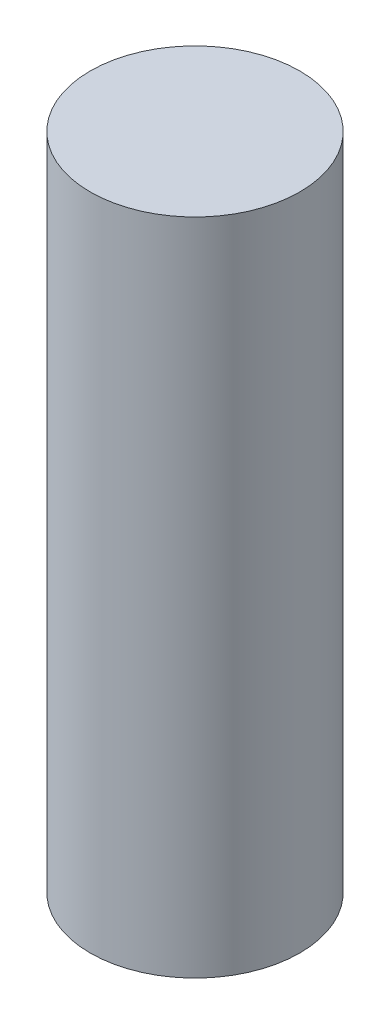
ISO-10303-21;
HEADER;
FILE_DESCRIPTION(('STEP AP214'),'2;1');
FILE_NAME('part.step','',(''),(''),'','','');
FILE_SCHEMA(('AUTOMOTIVE_DESIGN { 1 0 10303 214 1 1 1 1 }'));
ENDSEC;
DATA;
#1=APPLICATION_CONTEXT('core data for automotive mechanical design processes');
#2=APPLICATION_PROTOCOL_DEFINITION('international standard','automotive_design',2000,#1);
#3=PRODUCT_CONTEXT('',#1,'mechanical');
#4=PRODUCT('Part','Part','',(#3));
#5=PRODUCT_RELATED_PRODUCT_CATEGORY('part','',(#4));
#6=PRODUCT_DEFINITION_FORMATION('','',#4);
#7=PRODUCT_DEFINITION_CONTEXT('part definition',#1,'design');
#8=PRODUCT_DEFINITION('design','',#6,#7);
#9=PRODUCT_DEFINITION_SHAPE('','',#8);
#10=(LENGTH_UNIT() NAMED_UNIT(*) SI_UNIT(.MILLI.,.METRE.));
#11=(NAMED_UNIT(*) PLANE_ANGLE_UNIT() SI_UNIT($,.RADIAN.));
#12=(NAMED_UNIT(*) SI_UNIT($,.STERADIAN.) SOLID_ANGLE_UNIT());
#13=UNCERTAINTY_MEASURE_WITH_UNIT(LENGTH_MEASURE(1.E-05),#10,'distance_accuracy_value','');
#14=(GEOMETRIC_REPRESENTATION_CONTEXT(3) GLOBAL_UNCERTAINTY_ASSIGNED_CONTEXT((#13)) GLOBAL_UNIT_ASSIGNED_CONTEXT((#10,
#11,#12)) REPRESENTATION_CONTEXT('',''));
#15=CARTESIAN_POINT('',(0.,0.,0.));
#16=DIRECTION('',(0.,0.,1.));
#17=DIRECTION('',(1.,0.,0.));
#18=AXIS2_PLACEMENT_3D('',#15,#16,#17);
#19=CARTESIAN_POINT('',(0.,10.,0.));
#20=DIRECTION('',(0.,-1.,0.));
#21=DIRECTION('',(0.,0.,-1.));
#22=AXIS2_PLACEMENT_3D('',#19,#20,#21);
#23=CYLINDRICAL_SURFACE('',#22,1.59);
#24=CARTESIAN_POINT('',(0.,10.,0.));
#25=DIRECTION('',(0.,1.,0.));
#26=DIRECTION('',(0.,0.,1.));
#27=AXIS2_PLACEMENT_3D('',#24,#25,#26);
#28=CIRCLE('',#27,1.59);
#29=CARTESIAN_POINT('',(0.,10.,1.59));
#30=VERTEX_POINT('',#29);
#31=EDGE_CURVE('E10',#30,#30,#28,.T.);
#32=ORIENTED_EDGE('',*,*,#31,.F.);
#33=EDGE_LOOP('',(#32));
#34=FACE_BOUND('',#33,.T.);
#35=CARTESIAN_POINT('',(0.,0.,0.));
#36=DIRECTION('',(0.,1.,0.));
#37=DIRECTION('',(0.,0.,1.));
#38=AXIS2_PLACEMENT_3D('',#35,#36,#37);
#39=CIRCLE('',#38,1.59);
#40=CARTESIAN_POINT('',(0.,0.,1.59));
#41=VERTEX_POINT('',#40);
#42=EDGE_CURVE('E33',#41,#41,#39,.T.);
#43=ORIENTED_EDGE('',*,*,#42,.T.);
#44=EDGE_LOOP('',(#43));
#45=FACE_BOUND('',#44,.T.);
#46=ADVANCED_FACE('F30',(#34,#45),#23,.T.);
#47=CARTESIAN_POINT('',(0.,10.,0.));
#48=DIRECTION('',(0.,1.,0.));
#49=DIRECTION('',(0.,0.,1.));
#50=AXIS2_PLACEMENT_3D('',#47,#48,#49);
#51=PLANE('',#50);
#52=ORIENTED_EDGE('',*,*,#31,.T.);
#53=EDGE_LOOP('',(#52));
#54=FACE_BOUND('',#53,.T.);
#55=ADVANCED_FACE('F45',(#54),#51,.T.);
#56=CARTESIAN_POINT('',(0.,0.,0.));
#57=DIRECTION('',(0.,1.,0.));
#58=DIRECTION('',(0.,0.,1.));
#59=AXIS2_PLACEMENT_3D('',#56,#57,#58);
#60=PLANE('',#59);
#61=ORIENTED_EDGE('',*,*,#42,.F.);
#62=EDGE_LOOP('',(#61));
#63=FACE_BOUND('',#62,.T.);
#64=ADVANCED_FACE('F43',(#63),#60,.F.);
#65=CLOSED_SHELL('',(#46,#55,#64));
#66=MANIFOLD_SOLID_BREP('B2',#65);
#67=ADVANCED_BREP_SHAPE_REPRESENTATION('',(#18,#66),#14);
#68=SHAPE_DEFINITION_REPRESENTATION(#9,#67);
ENDSEC;
END-ISO-10303-21;
